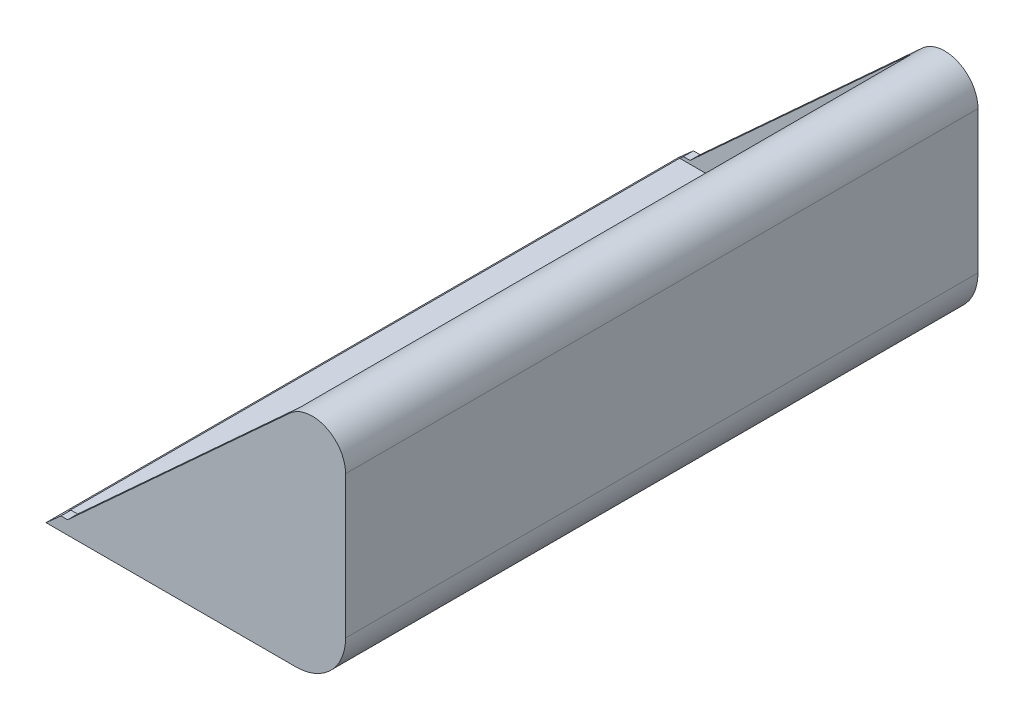
ISO-10303-21;
HEADER;
FILE_DESCRIPTION(('STEP AP214'),'2;1');
FILE_NAME('part.step','',(''),(''),'','','');
FILE_SCHEMA(('AUTOMOTIVE_DESIGN { 1 0 10303 214 1 1 1 1 }'));
ENDSEC;
DATA;
#1=APPLICATION_CONTEXT('core data for automotive mechanical design processes');
#2=APPLICATION_PROTOCOL_DEFINITION('international standard','automotive_design',2000,#1);
#3=PRODUCT_CONTEXT('',#1,'mechanical');
#4=PRODUCT('Part','Part','',(#3));
#5=PRODUCT_RELATED_PRODUCT_CATEGORY('part','',(#4));
#6=PRODUCT_DEFINITION_FORMATION('','',#4);
#7=PRODUCT_DEFINITION_CONTEXT('part definition',#1,'design');
#8=PRODUCT_DEFINITION('design','',#6,#7);
#9=PRODUCT_DEFINITION_SHAPE('','',#8);
#10=(LENGTH_UNIT() NAMED_UNIT(*) SI_UNIT(.MILLI.,.METRE.));
#11=(NAMED_UNIT(*) PLANE_ANGLE_UNIT() SI_UNIT($,.RADIAN.));
#12=(NAMED_UNIT(*) SI_UNIT($,.STERADIAN.) SOLID_ANGLE_UNIT());
#13=UNCERTAINTY_MEASURE_WITH_UNIT(LENGTH_MEASURE(1.E-05),#10,'distance_accuracy_value','');
#14=(GEOMETRIC_REPRESENTATION_CONTEXT(3) GLOBAL_UNCERTAINTY_ASSIGNED_CONTEXT((#13)) GLOBAL_UNIT_ASSIGNED_CONTEXT((#10,
#11,#12)) REPRESENTATION_CONTEXT('',''));
#15=CARTESIAN_POINT('',(0.,0.,0.));
#16=DIRECTION('',(0.,0.,1.));
#17=DIRECTION('',(1.,0.,0.));
#18=AXIS2_PLACEMENT_3D('',#15,#16,#17);
#19=CARTESIAN_POINT('',(733.563616117007,652.056547659561,1900.));
#20=DIRECTION('',(0.66436383882992,-0.74740931868366,0.));
#21=DIRECTION('',(0.74740931868366,0.66436383882992,0.));
#22=AXIS2_PLACEMENT_3D('',#19,#20,#21);
#23=PLANE('',#22);
#24=DIRECTION('',(-0.74740931868366,-0.66436383882992,0.));
#25=VECTOR('',#24,1.);
#26=CARTESIAN_POINT('',(733.563616117007,652.056547659561,1900.));
#27=LINE('',#26,#25);
#28=CARTESIAN_POINT('',(44.9999999999999,39.9999999999999,1900.));
#29=VERTEX_POINT('',#28);
#30=CARTESIAN_POINT('',(0.,0.,1900.));
#31=VERTEX_POINT('',#30);
#32=EDGE_CURVE('E198',#29,#31,#27,.T.);
#33=ORIENTED_EDGE('',*,*,#32,.F.);
#34=DIRECTION('',(0.,0.,1.));
#35=VECTOR('',#34,1.);
#36=CARTESIAN_POINT('',(44.9999999999999,39.9999999999999,0.));
#37=LINE('',#36,#35);
#38=CARTESIAN_POINT('',(44.9999999999999,39.9999999999999,1870.));
#39=VERTEX_POINT('',#38);
#40=EDGE_CURVE('E169',#39,#29,#37,.T.);
#41=ORIENTED_EDGE('',*,*,#40,.F.);
#42=DIRECTION('',(-0.74740931868366,-0.66436383882992,0.));
#43=VECTOR('',#42,1.);
#44=CARTESIAN_POINT('',(733.563616117007,652.056547659561,1870.));
#45=LINE('',#44,#43);
#46=CARTESIAN_POINT('',(33.75,30.,1870.));
#47=VERTEX_POINT('',#46);
#48=EDGE_CURVE('E270',#39,#47,#45,.T.);
#49=ORIENTED_EDGE('',*,*,#48,.T.);
#50=DIRECTION('',(0.,0.,-1.));
#51=VECTOR('',#50,1.);
#52=CARTESIAN_POINT('',(33.75,30.,1900.));
#53=LINE('',#52,#51);
#54=CARTESIAN_POINT('',(33.75,30.,30.));
#55=VERTEX_POINT('',#54);
#56=EDGE_CURVE('E268',#47,#55,#53,.T.);
#57=ORIENTED_EDGE('',*,*,#56,.T.);
#58=DIRECTION('',(-0.74740931868366,-0.66436383882992,0.));
#59=VECTOR('',#58,1.);
#60=CARTESIAN_POINT('',(733.563616117007,652.056547659561,30.));
#61=LINE('',#60,#59);
#62=CARTESIAN_POINT('',(44.9999999999998,39.9999999999999,30.));
#63=VERTEX_POINT('',#62);
#64=EDGE_CURVE('E167',#63,#55,#61,.T.);
#65=ORIENTED_EDGE('',*,*,#64,.F.);
#66=CARTESIAN_POINT('',(44.9999999999999,39.9999999999999,0.));
#67=VERTEX_POINT('',#66);
#68=EDGE_CURVE('E67',#67,#63,#37,.T.);
#69=ORIENTED_EDGE('',*,*,#68,.F.);
#70=DIRECTION('',(-0.74740931868366,-0.66436383882992,0.));
#71=VECTOR('',#70,1.);
#72=CARTESIAN_POINT('',(733.563616117007,652.056547659561,0.));
#73=LINE('',#72,#71);
#74=CARTESIAN_POINT('',(0.,0.,0.));
#75=VERTEX_POINT('',#74);
#76=EDGE_CURVE('E164',#67,#75,#73,.T.);
#77=ORIENTED_EDGE('',*,*,#76,.T.);
#78=DIRECTION('',(0.,0.,-1.));
#79=VECTOR('',#78,1.);
#80=CARTESIAN_POINT('',(0.,0.,1900.));
#81=LINE('',#80,#79);
#82=EDGE_CURVE('E215',#31,#75,#81,.T.);
#83=ORIENTED_EDGE('',*,*,#82,.F.);
#84=EDGE_LOOP('',(#33,#41,#49,#57,#65,#69,#77,#83));
#85=FACE_BOUND('',#84,.T.);
#86=ADVANCED_FACE('F44',(#85),#23,.F.);
#87=CARTESIAN_POINT('',(0.,0.,1900.));
#88=DIRECTION('',(0.,1.,0.));
#89=DIRECTION('',(0.,0.,1.));
#90=AXIS2_PLACEMENT_3D('',#87,#88,#89);
#91=PLANE('',#90);
#92=DIRECTION('',(1.,0.,0.));
#93=VECTOR('',#92,1.);
#94=CARTESIAN_POINT('',(0.,0.,0.));
#95=LINE('',#94,#93);
#96=CARTESIAN_POINT('',(749.999999999999,0.,0.));
#97=VERTEX_POINT('',#96);
#98=EDGE_CURVE('E173',#75,#97,#95,.T.);
#99=ORIENTED_EDGE('',*,*,#98,.T.);
#100=DIRECTION('',(0.,0.,-1.));
#101=VECTOR('',#100,1.);
#102=CARTESIAN_POINT('',(749.999999999999,0.,1900.));
#103=LINE('',#102,#101);
#104=CARTESIAN_POINT('',(749.999999999999,0.,1900.));
#105=VERTEX_POINT('',#104);
#106=EDGE_CURVE('E211',#105,#97,#103,.T.);
#107=ORIENTED_EDGE('',*,*,#106,.F.);
#108=DIRECTION('',(1.,0.,0.));
#109=VECTOR('',#108,1.);
#110=CARTESIAN_POINT('',(0.,0.,1900.));
#111=LINE('',#110,#109);
#112=EDGE_CURVE('E256',#31,#105,#111,.T.);
#113=ORIENTED_EDGE('',*,*,#112,.F.);
#114=ORIENTED_EDGE('',*,*,#82,.T.);
#115=EDGE_LOOP('',(#99,#107,#113,#114));
#116=FACE_BOUND('',#115,.T.);
#117=ADVANCED_FACE('F332',(#116),#91,.F.);
#118=CARTESIAN_POINT('',(750.,150.,1900.));
#119=DIRECTION('',(0.,0.,-1.));
#120=DIRECTION('',(-1.,0.,0.));
#121=AXIS2_PLACEMENT_3D('',#118,#119,#120);
#122=CYLINDRICAL_SURFACE('',#121,150.);
#123=CARTESIAN_POINT('',(750.,150.,0.));
#124=DIRECTION('',(0.,0.,1.));
#125=DIRECTION('',(1.,0.,0.));
#126=AXIS2_PLACEMENT_3D('',#123,#124,#125);
#127=CIRCLE('',#126,150.);
#128=CARTESIAN_POINT('',(900.,150.,0.));
#129=VERTEX_POINT('',#128);
#130=EDGE_CURVE('E180',#97,#129,#127,.T.);
#131=ORIENTED_EDGE('',*,*,#130,.T.);
#132=DIRECTION('',(0.,0.,-1.));
#133=VECTOR('',#132,1.);
#134=CARTESIAN_POINT('',(900.,150.,1900.));
#135=LINE('',#134,#133);
#136=CARTESIAN_POINT('',(900.,150.,1900.));
#137=VERTEX_POINT('',#136);
#138=EDGE_CURVE('E207',#137,#129,#135,.T.);
#139=ORIENTED_EDGE('',*,*,#138,.F.);
#140=CARTESIAN_POINT('',(750.,150.,1900.));
#141=DIRECTION('',(0.,0.,1.));
#142=DIRECTION('',(1.,0.,0.));
#143=AXIS2_PLACEMENT_3D('',#140,#141,#142);
#144=CIRCLE('',#143,150.);
#145=EDGE_CURVE('E252',#105,#137,#144,.T.);
#146=ORIENTED_EDGE('',*,*,#145,.F.);
#147=ORIENTED_EDGE('',*,*,#106,.T.);
#148=EDGE_LOOP('',(#131,#139,#146,#147));
#149=FACE_BOUND('',#148,.T.);
#150=ADVANCED_FACE('F337',(#149),#122,.T.);
#151=CARTESIAN_POINT('',(900.,150.000000000001,1900.));
#152=DIRECTION('',(-1.,0.,0.));
#153=DIRECTION('',(0.,0.,1.));
#154=AXIS2_PLACEMENT_3D('',#151,#152,#153);
#155=PLANE('',#154);
#156=DIRECTION('',(0.,1.,0.));
#157=VECTOR('',#156,1.);
#158=CARTESIAN_POINT('',(900.,150.000000000001,0.));
#159=LINE('',#158,#157);
#160=CARTESIAN_POINT('',(900.,577.315615791195,0.));
#161=VERTEX_POINT('',#160);
#162=EDGE_CURVE('E191',#129,#161,#159,.T.);
#163=ORIENTED_EDGE('',*,*,#162,.T.);
#164=DIRECTION('',(0.,0.,-1.));
#165=VECTOR('',#164,1.);
#166=CARTESIAN_POINT('',(900.,577.315615791195,1900.));
#167=LINE('',#166,#165);
#168=CARTESIAN_POINT('',(900.,577.315615791195,1900.));
#169=VERTEX_POINT('',#168);
#170=EDGE_CURVE('E202',#169,#161,#167,.T.);
#171=ORIENTED_EDGE('',*,*,#170,.F.);
#172=DIRECTION('',(0.,1.,0.));
#173=VECTOR('',#172,1.);
#174=CARTESIAN_POINT('',(900.,150.000000000001,1900.));
#175=LINE('',#174,#173);
#176=EDGE_CURVE('E247',#137,#169,#175,.T.);
#177=ORIENTED_EDGE('',*,*,#176,.F.);
#178=ORIENTED_EDGE('',*,*,#138,.T.);
#179=EDGE_LOOP('',(#163,#171,#177,#178));
#180=FACE_BOUND('',#179,.T.);
#181=ADVANCED_FACE('F340',(#180),#155,.F.);
#182=CARTESIAN_POINT('',(800.,577.315615791197,1900.));
#183=DIRECTION('',(0.,0.,-1.));
#184=DIRECTION('',(-1.,0.,0.));
#185=AXIS2_PLACEMENT_3D('',#182,#183,#184);
#186=CYLINDRICAL_SURFACE('',#185,100.);
#187=CARTESIAN_POINT('',(800.,577.315615791197,0.));
#188=DIRECTION('',(0.,0.,1.));
#189=DIRECTION('',(1.,0.,0.));
#190=AXIS2_PLACEMENT_3D('',#187,#188,#189);
#191=CIRCLE('',#190,100.);
#192=CARTESIAN_POINT('',(733.563616117007,652.056547659561,0.));
#193=VERTEX_POINT('',#192);
#194=EDGE_CURVE('E194',#161,#193,#191,.T.);
#195=ORIENTED_EDGE('',*,*,#194,.T.);
#196=DIRECTION('',(0.,0.,-1.));
#197=VECTOR('',#196,1.);
#198=CARTESIAN_POINT('',(733.563616117007,652.056547659561,1900.));
#199=LINE('',#198,#197);
#200=CARTESIAN_POINT('',(733.563616117007,652.056547659561,30.));
#201=VERTEX_POINT('',#200);
#202=EDGE_CURVE('E203',#201,#193,#199,.T.);
#203=ORIENTED_EDGE('',*,*,#202,.F.);
#204=DIRECTION('',(0.,0.,-1.));
#205=VECTOR('',#204,1.);
#206=CARTESIAN_POINT('',(733.563616117007,652.056547659561,1900.));
#207=LINE('',#206,#205);
#208=CARTESIAN_POINT('',(733.563616117007,652.056547659561,1870.));
#209=VERTEX_POINT('',#208);
#210=EDGE_CURVE('E242',#209,#201,#207,.T.);
#211=ORIENTED_EDGE('',*,*,#210,.F.);
#212=CARTESIAN_POINT('',(733.563616117007,652.056547659561,1900.));
#213=VERTEX_POINT('',#212);
#214=EDGE_CURVE('E199',#213,#209,#199,.T.);
#215=ORIENTED_EDGE('',*,*,#214,.F.);
#216=CARTESIAN_POINT('',(800.,577.315615791197,1900.));
#217=DIRECTION('',(0.,0.,1.));
#218=DIRECTION('',(1.,0.,0.));
#219=AXIS2_PLACEMENT_3D('',#216,#217,#218);
#220=CIRCLE('',#219,100.);
#221=EDGE_CURVE('E186',#169,#213,#220,.T.);
#222=ORIENTED_EDGE('',*,*,#221,.F.);
#223=ORIENTED_EDGE('',*,*,#170,.T.);
#224=EDGE_LOOP('',(#195,#203,#211,#215,#222,#223));
#225=FACE_BOUND('',#224,.T.);
#226=ADVANCED_FACE('F240',(#225),#186,.T.);
#227=CARTESIAN_POINT('',(750.,150.,1900.));
#228=DIRECTION('',(0.,0.,1.));
#229=DIRECTION('',(1.,0.,0.));
#230=AXIS2_PLACEMENT_3D('',#227,#228,#229);
#231=PLANE('',#230);
#232=DIRECTION('',(0.737590011375795,0.675248824596278,0.));
#233=VECTOR('',#232,1.);
#234=CARTESIAN_POINT('',(64.9999999999999,39.9999999999999,1900.));
#235=LINE('',#234,#233);
#236=CARTESIAN_POINT('',(64.9999999999999,39.9999999999999,1900.));
#237=VERTEX_POINT('',#236);
#238=EDGE_CURVE('E158',#237,#213,#235,.T.);
#239=ORIENTED_EDGE('',*,*,#238,.F.);
#240=DIRECTION('',(1.,0.,0.));
#241=VECTOR('',#240,1.);
#242=CARTESIAN_POINT('',(44.9999999999999,39.9999999999999,1900.));
#243=LINE('',#242,#241);
#244=EDGE_CURVE('E320',#29,#237,#243,.T.);
#245=ORIENTED_EDGE('',*,*,#244,.F.);
#246=ORIENTED_EDGE('',*,*,#32,.T.);
#247=ORIENTED_EDGE('',*,*,#112,.T.);
#248=ORIENTED_EDGE('',*,*,#145,.T.);
#249=ORIENTED_EDGE('',*,*,#176,.T.);
#250=ORIENTED_EDGE('',*,*,#221,.T.);
#251=EDGE_LOOP('',(#239,#245,#246,#247,#248,#249,#250));
#252=FACE_BOUND('',#251,.T.);
#253=ADVANCED_FACE('F329',(#252),#231,.T.);
#254=CARTESIAN_POINT('',(750.,150.,0.));
#255=DIRECTION('',(0.,0.,1.));
#256=DIRECTION('',(1.,0.,0.));
#257=AXIS2_PLACEMENT_3D('',#254,#255,#256);
#258=PLANE('',#257);
#259=DIRECTION('',(1.,0.,0.));
#260=VECTOR('',#259,1.);
#261=CARTESIAN_POINT('',(44.9999999999999,39.9999999999999,0.));
#262=LINE('',#261,#260);
#263=CARTESIAN_POINT('',(64.9999999999999,39.9999999999999,0.));
#264=VERTEX_POINT('',#263);
#265=EDGE_CURVE('E148',#67,#264,#262,.T.);
#266=ORIENTED_EDGE('',*,*,#265,.T.);
#267=DIRECTION('',(0.737590011375795,0.675248824596278,0.));
#268=VECTOR('',#267,1.);
#269=CARTESIAN_POINT('',(64.9999999999999,39.9999999999999,0.));
#270=LINE('',#269,#268);
#271=EDGE_CURVE('E157',#264,#193,#270,.T.);
#272=ORIENTED_EDGE('',*,*,#271,.T.);
#273=ORIENTED_EDGE('',*,*,#194,.F.);
#274=ORIENTED_EDGE('',*,*,#162,.F.);
#275=ORIENTED_EDGE('',*,*,#130,.F.);
#276=ORIENTED_EDGE('',*,*,#98,.F.);
#277=ORIENTED_EDGE('',*,*,#76,.F.);
#278=EDGE_LOOP('',(#266,#272,#273,#274,#275,#276,#277));
#279=FACE_BOUND('',#278,.T.);
#280=ADVANCED_FACE('F171',(#279),#258,.F.);
#281=CARTESIAN_POINT('',(733.563616117007,652.056547659561,1900.));
#282=DIRECTION('',(-0.74740931868366,-0.66436383882992,0.));
#283=DIRECTION('',(0.,0.,-1.));
#284=AXIS2_PLACEMENT_3D('',#281,#282,#283);
#285=PLANE('',#284);
#286=ORIENTED_EDGE('',*,*,#210,.T.);
#287=DIRECTION('',(-0.66436383882992,0.74740931868366,0.));
#288=VECTOR('',#287,1.);
#289=CARTESIAN_POINT('',(733.563616117007,652.056547659561,30.));
#290=LINE('',#289,#288);
#291=CARTESIAN_POINT('',(753.494531281904,629.634268099051,30.));
#292=VERTEX_POINT('',#291);
#293=EDGE_CURVE('E183',#292,#201,#290,.T.);
#294=ORIENTED_EDGE('',*,*,#293,.F.);
#295=DIRECTION('',(0.,0.,-1.));
#296=VECTOR('',#295,1.);
#297=CARTESIAN_POINT('',(753.494531281904,629.634268099051,949.9999));
#298=LINE('',#297,#296);
#299=CARTESIAN_POINT('',(753.494531281904,629.634268099051,1870.));
#300=VERTEX_POINT('',#299);
#301=EDGE_CURVE('E236',#300,#292,#298,.T.);
#302=ORIENTED_EDGE('',*,*,#301,.F.);
#303=DIRECTION('',(0.66436383882992,-0.74740931868366,0.));
#304=VECTOR('',#303,1.);
#305=CARTESIAN_POINT('',(990.115340254938,363.435858004389,1870.));
#306=LINE('',#305,#304);
#307=EDGE_CURVE('E176',#300,#209,#306,.F.);
#308=ORIENTED_EDGE('',*,*,#307,.T.);
#309=EDGE_LOOP('',(#286,#294,#302,#308));
#310=FACE_BOUND('',#309,.T.);
#311=ADVANCED_FACE('F346',(#310),#285,.T.);
#312=CARTESIAN_POINT('',(0.,30.,1900.));
#313=DIRECTION('',(0.,1.,0.));
#314=DIRECTION('',(0.,0.,1.));
#315=AXIS2_PLACEMENT_3D('',#312,#313,#314);
#316=PLANE('',#315);
#317=DIRECTION('',(1.,0.,0.));
#318=VECTOR('',#317,1.);
#319=CARTESIAN_POINT('',(0.,30.,30.));
#320=LINE('',#319,#318);
#321=CARTESIAN_POINT('',(749.999999999999,30.,30.));
#322=VERTEX_POINT('',#321);
#323=EDGE_CURVE('E265',#55,#322,#320,.T.);
#324=ORIENTED_EDGE('',*,*,#323,.F.);
#325=ORIENTED_EDGE('',*,*,#56,.F.);
#326=DIRECTION('',(1.,0.,0.));
#327=VECTOR('',#326,1.);
#328=CARTESIAN_POINT('',(0.,30.,1870.));
#329=LINE('',#328,#327);
#330=CARTESIAN_POINT('',(749.999999999999,30.,1870.));
#331=VERTEX_POINT('',#330);
#332=EDGE_CURVE('E273',#47,#331,#329,.T.);
#333=ORIENTED_EDGE('',*,*,#332,.T.);
#334=DIRECTION('',(0.,0.,-1.));
#335=VECTOR('',#334,1.);
#336=CARTESIAN_POINT('',(749.999999999999,30.,1900.));
#337=LINE('',#336,#335);
#338=EDGE_CURVE('E276',#331,#322,#337,.T.);
#339=ORIENTED_EDGE('',*,*,#338,.T.);
#340=EDGE_LOOP('',(#324,#325,#333,#339));
#341=FACE_BOUND('',#340,.T.);
#342=ADVANCED_FACE('F363',(#341),#316,.T.);
#343=CARTESIAN_POINT('',(750.,150.,1900.));
#344=DIRECTION('',(0.,0.,-1.));
#345=DIRECTION('',(-1.,0.,0.));
#346=AXIS2_PLACEMENT_3D('',#343,#344,#345);
#347=CYLINDRICAL_SURFACE('',#346,120.);
#348=CARTESIAN_POINT('',(750.,150.,30.));
#349=DIRECTION('',(0.,0.,1.));
#350=DIRECTION('',(1.,0.,0.));
#351=AXIS2_PLACEMENT_3D('',#348,#349,#350);
#352=CIRCLE('',#351,120.);
#353=CARTESIAN_POINT('',(870.,150.,30.));
#354=VERTEX_POINT('',#353);
#355=EDGE_CURVE('E295',#322,#354,#352,.T.);
#356=ORIENTED_EDGE('',*,*,#355,.F.);
#357=ORIENTED_EDGE('',*,*,#338,.F.);
#358=CARTESIAN_POINT('',(750.,150.,1870.));
#359=DIRECTION('',(0.,0.,1.));
#360=DIRECTION('',(1.,0.,0.));
#361=AXIS2_PLACEMENT_3D('',#358,#359,#360);
#362=CIRCLE('',#361,120.);
#363=CARTESIAN_POINT('',(870.,150.,1870.));
#364=VERTEX_POINT('',#363);
#365=EDGE_CURVE('E287',#331,#364,#362,.T.);
#366=ORIENTED_EDGE('',*,*,#365,.T.);
#367=DIRECTION('',(0.,0.,1.));
#368=VECTOR('',#367,1.);
#369=CARTESIAN_POINT('',(870.,150.,1900.));
#370=LINE('',#369,#368);
#371=EDGE_CURVE('E292',#364,#354,#370,.F.);
#372=ORIENTED_EDGE('',*,*,#371,.T.);
#373=EDGE_LOOP('',(#356,#357,#366,#372));
#374=FACE_BOUND('',#373,.T.);
#375=ADVANCED_FACE('F359',(#374),#347,.F.);
#376=CARTESIAN_POINT('',(870.,150.000000000001,1900.));
#377=DIRECTION('',(-1.,0.,0.));
#378=DIRECTION('',(0.,0.,1.));
#379=AXIS2_PLACEMENT_3D('',#376,#377,#378);
#380=PLANE('',#379);
#381=DIRECTION('',(0.,1.,0.));
#382=VECTOR('',#381,1.);
#383=CARTESIAN_POINT('',(870.,150.000000000001,30.));
#384=LINE('',#383,#382);
#385=CARTESIAN_POINT('',(870.,577.315615791195,30.));
#386=VERTEX_POINT('',#385);
#387=EDGE_CURVE('E284',#354,#386,#384,.T.);
#388=ORIENTED_EDGE('',*,*,#387,.F.);
#389=ORIENTED_EDGE('',*,*,#371,.F.);
#390=DIRECTION('',(0.,1.,0.));
#391=VECTOR('',#390,1.);
#392=CARTESIAN_POINT('',(870.,150.000000000001,1870.));
#393=LINE('',#392,#391);
#394=CARTESIAN_POINT('',(870.,577.315615791195,1870.));
#395=VERTEX_POINT('',#394);
#396=EDGE_CURVE('E281',#364,#395,#393,.T.);
#397=ORIENTED_EDGE('',*,*,#396,.T.);
#398=DIRECTION('',(0.,0.,-1.));
#399=VECTOR('',#398,1.);
#400=CARTESIAN_POINT('',(870.,577.315615791195,1900.));
#401=LINE('',#400,#399);
#402=EDGE_CURVE('E288',#395,#386,#401,.T.);
#403=ORIENTED_EDGE('',*,*,#402,.T.);
#404=EDGE_LOOP('',(#388,#389,#397,#403));
#405=FACE_BOUND('',#404,.T.);
#406=ADVANCED_FACE('F356',(#405),#380,.T.);
#407=CARTESIAN_POINT('',(800.,577.315615791197,1900.));
#408=DIRECTION('',(0.,0.,-1.));
#409=DIRECTION('',(-1.,0.,0.));
#410=AXIS2_PLACEMENT_3D('',#407,#408,#409);
#411=CYLINDRICAL_SURFACE('',#410,70.);
#412=CARTESIAN_POINT('',(800.,577.315615791197,30.));
#413=DIRECTION('',(0.,0.,1.));
#414=DIRECTION('',(1.,0.,0.));
#415=AXIS2_PLACEMENT_3D('',#412,#413,#414);
#416=CIRCLE('',#415,70.);
#417=EDGE_CURVE('E231',#386,#292,#416,.T.);
#418=ORIENTED_EDGE('',*,*,#417,.F.);
#419=ORIENTED_EDGE('',*,*,#402,.F.);
#420=CARTESIAN_POINT('',(800.,577.315615791197,1870.));
#421=DIRECTION('',(0.,0.,1.));
#422=DIRECTION('',(1.,0.,0.));
#423=AXIS2_PLACEMENT_3D('',#420,#421,#422);
#424=CIRCLE('',#423,70.);
#425=EDGE_CURVE('E277',#395,#300,#424,.T.);
#426=ORIENTED_EDGE('',*,*,#425,.T.);
#427=ORIENTED_EDGE('',*,*,#301,.T.);
#428=EDGE_LOOP('',(#418,#419,#426,#427));
#429=FACE_BOUND('',#428,.T.);
#430=ADVANCED_FACE('F348',(#429),#411,.F.);
#431=CARTESIAN_POINT('',(750.,150.,1870.));
#432=DIRECTION('',(0.,0.,1.));
#433=DIRECTION('',(1.,0.,0.));
#434=AXIS2_PLACEMENT_3D('',#431,#432,#433);
#435=PLANE('',#434);
#436=DIRECTION('',(1.,0.,0.));
#437=VECTOR('',#436,1.);
#438=CARTESIAN_POINT('',(750.,39.9999999999999,1870.));
#439=LINE('',#438,#437);
#440=CARTESIAN_POINT('',(64.9999999999998,39.9999999999999,1870.));
#441=VERTEX_POINT('',#440);
#442=EDGE_CURVE('E224',#39,#441,#439,.T.);
#443=ORIENTED_EDGE('',*,*,#442,.T.);
#444=DIRECTION('',(0.737590011375795,0.675248824596278,0.));
#445=VECTOR('',#444,1.);
#446=CARTESIAN_POINT('',(492.452978747422,431.324607190643,1870.));
#447=LINE('',#446,#445);
#448=EDGE_CURVE('E266',#441,#209,#447,.T.);
#449=ORIENTED_EDGE('',*,*,#448,.T.);
#450=ORIENTED_EDGE('',*,*,#307,.F.);
#451=ORIENTED_EDGE('',*,*,#425,.F.);
#452=ORIENTED_EDGE('',*,*,#396,.F.);
#453=ORIENTED_EDGE('',*,*,#365,.F.);
#454=ORIENTED_EDGE('',*,*,#332,.F.);
#455=ORIENTED_EDGE('',*,*,#48,.F.);
#456=EDGE_LOOP('',(#443,#449,#450,#451,#452,#453,#454,#455));
#457=FACE_BOUND('',#456,.T.);
#458=ADVANCED_FACE('F344',(#457),#435,.F.);
#459=CARTESIAN_POINT('',(750.,150.,30.));
#460=DIRECTION('',(0.,0.,1.));
#461=DIRECTION('',(1.,0.,0.));
#462=AXIS2_PLACEMENT_3D('',#459,#460,#461);
#463=PLANE('',#462);
#464=DIRECTION('',(0.737590011375795,0.675248824596278,0.));
#465=VECTOR('',#464,1.);
#466=CARTESIAN_POINT('',(492.452978747422,431.324607190643,30.));
#467=LINE('',#466,#465);
#468=CARTESIAN_POINT('',(64.9999999999999,39.9999999999999,30.));
#469=VERTEX_POINT('',#468);
#470=EDGE_CURVE('E11',#469,#201,#467,.T.);
#471=ORIENTED_EDGE('',*,*,#470,.F.);
#472=DIRECTION('',(1.,0.,0.));
#473=VECTOR('',#472,1.);
#474=CARTESIAN_POINT('',(750.,39.9999999999999,30.));
#475=LINE('',#474,#473);
#476=EDGE_CURVE('E52',#63,#469,#475,.T.);
#477=ORIENTED_EDGE('',*,*,#476,.F.);
#478=ORIENTED_EDGE('',*,*,#64,.T.);
#479=ORIENTED_EDGE('',*,*,#323,.T.);
#480=ORIENTED_EDGE('',*,*,#355,.T.);
#481=ORIENTED_EDGE('',*,*,#387,.T.);
#482=ORIENTED_EDGE('',*,*,#417,.T.);
#483=ORIENTED_EDGE('',*,*,#293,.T.);
#484=EDGE_LOOP('',(#471,#477,#478,#479,#480,#481,#482,#483));
#485=FACE_BOUND('',#484,.T.);
#486=ADVANCED_FACE('F227',(#485),#463,.T.);
#487=CARTESIAN_POINT('',(44.9999999999999,39.9999999999999,0.));
#488=DIRECTION('',(0.,-1.,0.));
#489=DIRECTION('',(0.,0.,-1.));
#490=AXIS2_PLACEMENT_3D('',#487,#488,#489);
#491=PLANE('',#490);
#492=ORIENTED_EDGE('',*,*,#476,.T.);
#493=DIRECTION('',(0.,0.,1.));
#494=VECTOR('',#493,1.);
#495=CARTESIAN_POINT('',(64.9999999999999,39.9999999999999,0.));
#496=LINE('',#495,#494);
#497=EDGE_CURVE('E151',#264,#469,#496,.T.);
#498=ORIENTED_EDGE('',*,*,#497,.F.);
#499=ORIENTED_EDGE('',*,*,#265,.F.);
#500=ORIENTED_EDGE('',*,*,#68,.T.);
#501=EDGE_LOOP('',(#492,#498,#499,#500));
#502=FACE_BOUND('',#501,.T.);
#503=ADVANCED_FACE('F149',(#502),#491,.F.);
#504=CARTESIAN_POINT('',(64.9999999999999,39.9999999999999,0.));
#505=DIRECTION('',(0.675248824596278,-0.737590011375795,0.));
#506=DIRECTION('',(0.737590011375795,0.675248824596278,0.));
#507=AXIS2_PLACEMENT_3D('',#504,#505,#506);
#508=PLANE('',#507);
#509=ORIENTED_EDGE('',*,*,#470,.T.);
#510=ORIENTED_EDGE('',*,*,#202,.T.);
#511=ORIENTED_EDGE('',*,*,#271,.F.);
#512=ORIENTED_EDGE('',*,*,#497,.T.);
#513=EDGE_LOOP('',(#509,#510,#511,#512));
#514=FACE_BOUND('',#513,.T.);
#515=ADVANCED_FACE('F221',(#514),#508,.F.);
#516=EDGE_CURVE('E59',#441,#237,#496,.T.);
#517=ORIENTED_EDGE('',*,*,#516,.T.);
#518=ORIENTED_EDGE('',*,*,#238,.T.);
#519=ORIENTED_EDGE('',*,*,#214,.T.);
#520=ORIENTED_EDGE('',*,*,#448,.F.);
#521=EDGE_LOOP('',(#517,#518,#519,#520));
#522=FACE_BOUND('',#521,.T.);
#523=ADVANCED_FACE('F342',(#522),#508,.F.);
#524=ORIENTED_EDGE('',*,*,#40,.T.);
#525=ORIENTED_EDGE('',*,*,#244,.T.);
#526=ORIENTED_EDGE('',*,*,#516,.F.);
#527=ORIENTED_EDGE('',*,*,#442,.F.);
#528=EDGE_LOOP('',(#524,#525,#526,#527));
#529=FACE_BOUND('',#528,.T.);
#530=ADVANCED_FACE('F327',(#529),#491,.F.);
#531=CLOSED_SHELL('',(#86,#117,#150,#181,#226,#253,#280,#311,#342,#375,#406,#430,#458,#486,#503,
#515,#523,#530));
#532=MANIFOLD_SOLID_BREP('B2',#531);
#533=ADVANCED_BREP_SHAPE_REPRESENTATION('',(#18,#532),#14);
#534=SHAPE_DEFINITION_REPRESENTATION(#9,#533);
ENDSEC;
END-ISO-10303-21;
